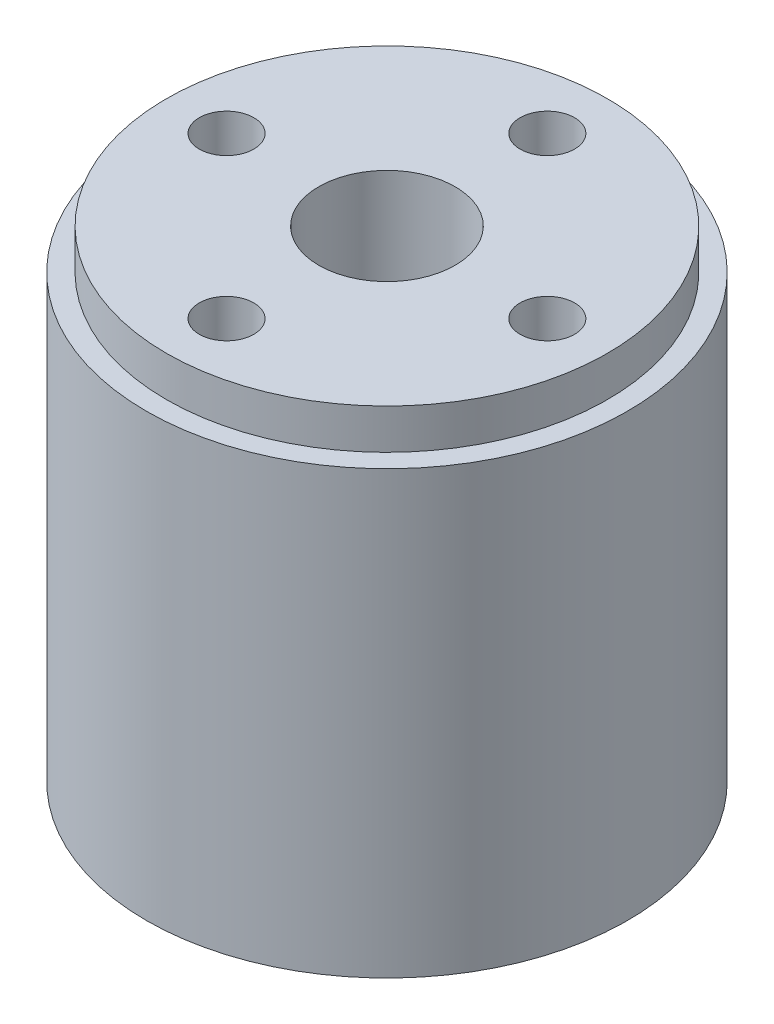
ISO-10303-21;
HEADER;
FILE_DESCRIPTION(('STEP AP214'),'2;1');
FILE_NAME('part.step','',(''),(''),'','','');
FILE_SCHEMA(('AUTOMOTIVE_DESIGN { 1 0 10303 214 1 1 1 1 }'));
ENDSEC;
DATA;
#1=APPLICATION_CONTEXT('core data for automotive mechanical design processes');
#2=APPLICATION_PROTOCOL_DEFINITION('international standard','automotive_design',2000,#1);
#3=PRODUCT_CONTEXT('',#1,'mechanical');
#4=PRODUCT('Part','Part','',(#3));
#5=PRODUCT_RELATED_PRODUCT_CATEGORY('part','',(#4));
#6=PRODUCT_DEFINITION_FORMATION('','',#4);
#7=PRODUCT_DEFINITION_CONTEXT('part definition',#1,'design');
#8=PRODUCT_DEFINITION('design','',#6,#7);
#9=PRODUCT_DEFINITION_SHAPE('','',#8);
#10=(LENGTH_UNIT() NAMED_UNIT(*) SI_UNIT(.MILLI.,.METRE.));
#11=(NAMED_UNIT(*) PLANE_ANGLE_UNIT() SI_UNIT($,.RADIAN.));
#12=(NAMED_UNIT(*) SI_UNIT($,.STERADIAN.) SOLID_ANGLE_UNIT());
#13=UNCERTAINTY_MEASURE_WITH_UNIT(LENGTH_MEASURE(1.E-05),#10,'distance_accuracy_value','');
#14=(GEOMETRIC_REPRESENTATION_CONTEXT(3) GLOBAL_UNCERTAINTY_ASSIGNED_CONTEXT((#13)) GLOBAL_UNIT_ASSIGNED_CONTEXT((#10,
#11,#12)) REPRESENTATION_CONTEXT('',''));
#15=CARTESIAN_POINT('',(0.,0.,0.));
#16=DIRECTION('',(0.,0.,1.));
#17=DIRECTION('',(1.,0.,0.));
#18=AXIS2_PLACEMENT_3D('',#15,#16,#17);
#19=CARTESIAN_POINT('',(0.,60.,0.));
#20=DIRECTION('',(0.,1.,0.));
#21=DIRECTION('',(0.,0.,1.));
#22=AXIS2_PLACEMENT_3D('',#19,#20,#21);
#23=PLANE('',#22);
#24=CARTESIAN_POINT('',(0.,60.,20.));
#25=DIRECTION('',(0.,1.,0.));
#26=DIRECTION('',(0.,0.,1.));
#27=AXIS2_PLACEMENT_3D('',#24,#25,#26);
#28=CIRCLE('',#27,3.40000000000006);
#29=CARTESIAN_POINT('',(0.,60.,23.4000000000001));
#30=VERTEX_POINT('',#29);
#31=EDGE_CURVE('E69',#30,#30,#28,.T.);
#32=ORIENTED_EDGE('',*,*,#31,.F.);
#33=EDGE_LOOP('',(#32));
#34=FACE_BOUND('',#33,.T.);
#35=CARTESIAN_POINT('',(0.,60.,-20.));
#36=DIRECTION('',(0.,1.,0.));
#37=DIRECTION('',(0.,0.,1.));
#38=AXIS2_PLACEMENT_3D('',#35,#36,#37);
#39=CIRCLE('',#38,3.40000000000001);
#40=CARTESIAN_POINT('',(0.,60.,-16.6));
#41=VERTEX_POINT('',#40);
#42=EDGE_CURVE('E57',#41,#41,#39,.T.);
#43=ORIENTED_EDGE('',*,*,#42,.F.);
#44=EDGE_LOOP('',(#43));
#45=FACE_BOUND('',#44,.T.);
#46=CARTESIAN_POINT('',(0.,60.,0.));
#47=DIRECTION('',(0.,1.,0.));
#48=DIRECTION('',(0.,0.,1.));
#49=AXIS2_PLACEMENT_3D('',#46,#47,#48);
#50=CIRCLE('',#49,8.5);
#51=CARTESIAN_POINT('',(0.,60.,8.5));
#52=VERTEX_POINT('',#51);
#53=EDGE_CURVE('E48',#52,#52,#50,.T.);
#54=ORIENTED_EDGE('',*,*,#53,.F.);
#55=EDGE_LOOP('',(#54));
#56=FACE_BOUND('',#55,.T.);
#57=CARTESIAN_POINT('',(-20.,60.,0.));
#58=DIRECTION('',(0.,1.,0.));
#59=DIRECTION('',(0.,0.,1.));
#60=AXIS2_PLACEMENT_3D('',#57,#58,#59);
#61=CIRCLE('',#60,3.4);
#62=CARTESIAN_POINT('',(-20.,60.,3.4));
#63=VERTEX_POINT('',#62);
#64=EDGE_CURVE('E53',#63,#63,#61,.T.);
#65=ORIENTED_EDGE('',*,*,#64,.F.);
#66=EDGE_LOOP('',(#65));
#67=FACE_BOUND('',#66,.T.);
#68=CARTESIAN_POINT('',(20.,60.,1.37209959955431E-13));
#69=DIRECTION('',(0.,1.,0.));
#70=DIRECTION('',(0.,0.,1.));
#71=AXIS2_PLACEMENT_3D('',#68,#69,#70);
#72=CIRCLE('',#71,3.4);
#73=CARTESIAN_POINT('',(20.,60.,3.40000000000014));
#74=VERTEX_POINT('',#73);
#75=EDGE_CURVE('E63',#74,#74,#72,.T.);
#76=ORIENTED_EDGE('',*,*,#75,.F.);
#77=EDGE_LOOP('',(#76));
#78=FACE_BOUND('',#77,.T.);
#79=CARTESIAN_POINT('',(0.,60.,0.));
#80=DIRECTION('',(0.,1.,0.));
#81=DIRECTION('',(0.,0.,1.));
#82=AXIS2_PLACEMENT_3D('',#79,#80,#81);
#83=CIRCLE('',#82,27.5);
#84=CARTESIAN_POINT('',(0.,60.,27.5));
#85=VERTEX_POINT('',#84);
#86=EDGE_CURVE('E81',#85,#85,#83,.T.);
#87=ORIENTED_EDGE('',*,*,#86,.T.);
#88=EDGE_LOOP('',(#87));
#89=FACE_BOUND('',#88,.T.);
#90=ADVANCED_FACE('F32',(#34,#45,#56,#67,#78,#89),#23,.T.);
#91=CARTESIAN_POINT('',(0.,60.,0.));
#92=DIRECTION('',(0.,-1.,0.));
#93=DIRECTION('',(0.,0.,-1.));
#94=AXIS2_PLACEMENT_3D('',#91,#92,#93);
#95=CYLINDRICAL_SURFACE('',#94,30.);
#96=CARTESIAN_POINT('',(0.,0.,0.));
#97=DIRECTION('',(0.,1.,0.));
#98=DIRECTION('',(0.,0.,1.));
#99=AXIS2_PLACEMENT_3D('',#96,#97,#98);
#100=CIRCLE('',#99,30.);
#101=CARTESIAN_POINT('',(0.,0.,30.));
#102=VERTEX_POINT('',#101);
#103=EDGE_CURVE('E44',#102,#102,#100,.T.);
#104=ORIENTED_EDGE('',*,*,#103,.T.);
#105=EDGE_LOOP('',(#104));
#106=FACE_BOUND('',#105,.T.);
#107=CARTESIAN_POINT('',(0.,55.,0.));
#108=DIRECTION('',(0.,1.,0.));
#109=DIRECTION('',(0.,0.,1.));
#110=AXIS2_PLACEMENT_3D('',#107,#108,#109);
#111=CIRCLE('',#110,30.);
#112=CARTESIAN_POINT('',(0.,55.,30.));
#113=VERTEX_POINT('',#112);
#114=EDGE_CURVE('E75',#113,#113,#111,.T.);
#115=ORIENTED_EDGE('',*,*,#114,.F.);
#116=EDGE_LOOP('',(#115));
#117=FACE_BOUND('',#116,.T.);
#118=ADVANCED_FACE('F97',(#106,#117),#95,.T.);
#119=CARTESIAN_POINT('',(0.,0.,0.));
#120=DIRECTION('',(0.,1.,0.));
#121=DIRECTION('',(0.,0.,1.));
#122=AXIS2_PLACEMENT_3D('',#119,#120,#121);
#123=PLANE('',#122);
#124=CARTESIAN_POINT('',(0.,0.,0.));
#125=DIRECTION('',(0.,1.,0.));
#126=DIRECTION('',(0.,0.,1.));
#127=AXIS2_PLACEMENT_3D('',#124,#125,#126);
#128=CIRCLE('',#127,13.5);
#129=CARTESIAN_POINT('',(0.,0.,13.5));
#130=VERTEX_POINT('',#129);
#131=EDGE_CURVE('E40',#130,#130,#128,.T.);
#132=ORIENTED_EDGE('',*,*,#131,.T.);
#133=EDGE_LOOP('',(#132));
#134=FACE_BOUND('',#133,.T.);
#135=ORIENTED_EDGE('',*,*,#103,.F.);
#136=EDGE_LOOP('',(#135));
#137=FACE_BOUND('',#136,.T.);
#138=CARTESIAN_POINT('',(-20.,0.,0.));
#139=DIRECTION('',(0.,1.,0.));
#140=DIRECTION('',(0.,0.,1.));
#141=AXIS2_PLACEMENT_3D('',#138,#139,#140);
#142=CIRCLE('',#141,3.4);
#143=CARTESIAN_POINT('',(-20.,0.,3.4));
#144=VERTEX_POINT('',#143);
#145=EDGE_CURVE('E54',#144,#144,#142,.T.);
#146=ORIENTED_EDGE('',*,*,#145,.T.);
#147=EDGE_LOOP('',(#146));
#148=FACE_BOUND('',#147,.T.);
#149=CARTESIAN_POINT('',(0.,0.,-20.));
#150=DIRECTION('',(0.,1.,0.));
#151=DIRECTION('',(0.,0.,1.));
#152=AXIS2_PLACEMENT_3D('',#149,#150,#151);
#153=CIRCLE('',#152,3.40000000000001);
#154=CARTESIAN_POINT('',(0.,0.,-16.6));
#155=VERTEX_POINT('',#154);
#156=EDGE_CURVE('E60',#155,#155,#153,.T.);
#157=ORIENTED_EDGE('',*,*,#156,.T.);
#158=EDGE_LOOP('',(#157));
#159=FACE_BOUND('',#158,.T.);
#160=CARTESIAN_POINT('',(20.,0.,1.37209959955431E-13));
#161=DIRECTION('',(0.,1.,0.));
#162=DIRECTION('',(0.,0.,1.));
#163=AXIS2_PLACEMENT_3D('',#160,#161,#162);
#164=CIRCLE('',#163,3.4);
#165=CARTESIAN_POINT('',(20.,0.,3.40000000000014));
#166=VERTEX_POINT('',#165);
#167=EDGE_CURVE('E66',#166,#166,#164,.T.);
#168=ORIENTED_EDGE('',*,*,#167,.T.);
#169=EDGE_LOOP('',(#168));
#170=FACE_BOUND('',#169,.T.);
#171=CARTESIAN_POINT('',(0.,0.,20.));
#172=DIRECTION('',(0.,1.,0.));
#173=DIRECTION('',(0.,0.,1.));
#174=AXIS2_PLACEMENT_3D('',#171,#172,#173);
#175=CIRCLE('',#174,3.40000000000006);
#176=CARTESIAN_POINT('',(0.,0.,23.4000000000001));
#177=VERTEX_POINT('',#176);
#178=EDGE_CURVE('E72',#177,#177,#175,.T.);
#179=ORIENTED_EDGE('',*,*,#178,.T.);
#180=EDGE_LOOP('',(#179));
#181=FACE_BOUND('',#180,.T.);
#182=ADVANCED_FACE('F99',(#134,#137,#148,#159,#170,#181),#123,.F.);
#183=CARTESIAN_POINT('',(0.,60.,0.));
#184=DIRECTION('',(0.,-1.,0.));
#185=DIRECTION('',(0.,0.,-1.));
#186=AXIS2_PLACEMENT_3D('',#183,#184,#185);
#187=CYLINDRICAL_SURFACE('',#186,8.5);
#188=CARTESIAN_POINT('',(0.,5.00000000000004,0.));
#189=DIRECTION('',(0.,1.,0.));
#190=DIRECTION('',(0.,0.,1.));
#191=AXIS2_PLACEMENT_3D('',#188,#189,#190);
#192=CIRCLE('',#191,8.5);
#193=CARTESIAN_POINT('',(0.,5.00000000000004,8.5));
#194=VERTEX_POINT('',#193);
#195=EDGE_CURVE('E10',#194,#194,#192,.F.);
#196=ORIENTED_EDGE('',*,*,#195,.T.);
#197=EDGE_LOOP('',(#196));
#198=FACE_BOUND('',#197,.T.);
#199=ORIENTED_EDGE('',*,*,#53,.T.);
#200=EDGE_LOOP('',(#199));
#201=FACE_BOUND('',#200,.T.);
#202=ADVANCED_FACE('F105',(#198,#201),#187,.F.);
#203=CARTESIAN_POINT('',(-20.,60.,0.));
#204=DIRECTION('',(0.,-1.,0.));
#205=DIRECTION('',(0.,0.,-1.));
#206=AXIS2_PLACEMENT_3D('',#203,#204,#205);
#207=CYLINDRICAL_SURFACE('',#206,3.4);
#208=ORIENTED_EDGE('',*,*,#64,.T.);
#209=EDGE_LOOP('',(#208));
#210=FACE_BOUND('',#209,.T.);
#211=ORIENTED_EDGE('',*,*,#145,.F.);
#212=EDGE_LOOP('',(#211));
#213=FACE_BOUND('',#212,.T.);
#214=ADVANCED_FACE('F112',(#210,#213),#207,.F.);
#215=CARTESIAN_POINT('',(0.,60.,-20.));
#216=DIRECTION('',(0.,-1.,0.));
#217=DIRECTION('',(0.,0.,-1.));
#218=AXIS2_PLACEMENT_3D('',#215,#216,#217);
#219=CYLINDRICAL_SURFACE('',#218,3.40000000000001);
#220=ORIENTED_EDGE('',*,*,#42,.T.);
#221=EDGE_LOOP('',(#220));
#222=FACE_BOUND('',#221,.T.);
#223=ORIENTED_EDGE('',*,*,#156,.F.);
#224=EDGE_LOOP('',(#223));
#225=FACE_BOUND('',#224,.T.);
#226=ADVANCED_FACE('F115',(#222,#225),#219,.F.);
#227=CARTESIAN_POINT('',(20.,60.,1.37209959955431E-13));
#228=DIRECTION('',(0.,-1.,0.));
#229=DIRECTION('',(0.,0.,-1.));
#230=AXIS2_PLACEMENT_3D('',#227,#228,#229);
#231=CYLINDRICAL_SURFACE('',#230,3.4);
#232=ORIENTED_EDGE('',*,*,#75,.T.);
#233=EDGE_LOOP('',(#232));
#234=FACE_BOUND('',#233,.T.);
#235=ORIENTED_EDGE('',*,*,#167,.F.);
#236=EDGE_LOOP('',(#235));
#237=FACE_BOUND('',#236,.T.);
#238=ADVANCED_FACE('F119',(#234,#237),#231,.F.);
#239=CARTESIAN_POINT('',(0.,60.,20.));
#240=DIRECTION('',(0.,-1.,0.));
#241=DIRECTION('',(0.,0.,-1.));
#242=AXIS2_PLACEMENT_3D('',#239,#240,#241);
#243=CYLINDRICAL_SURFACE('',#242,3.40000000000006);
#244=ORIENTED_EDGE('',*,*,#31,.T.);
#245=EDGE_LOOP('',(#244));
#246=FACE_BOUND('',#245,.T.);
#247=ORIENTED_EDGE('',*,*,#178,.F.);
#248=EDGE_LOOP('',(#247));
#249=FACE_BOUND('',#248,.T.);
#250=ADVANCED_FACE('F93',(#246,#249),#243,.F.);
#251=CARTESIAN_POINT('',(0.,55.,0.));
#252=DIRECTION('',(0.,1.,0.));
#253=DIRECTION('',(0.,0.,1.));
#254=AXIS2_PLACEMENT_3D('',#251,#252,#253);
#255=PLANE('',#254);
#256=CARTESIAN_POINT('',(0.,55.,0.));
#257=DIRECTION('',(0.,1.,0.));
#258=DIRECTION('',(0.,0.,1.));
#259=AXIS2_PLACEMENT_3D('',#256,#257,#258);
#260=CIRCLE('',#259,27.5);
#261=CARTESIAN_POINT('',(0.,55.,27.5));
#262=VERTEX_POINT('',#261);
#263=EDGE_CURVE('E80',#262,#262,#260,.T.);
#264=ORIENTED_EDGE('',*,*,#263,.F.);
#265=EDGE_LOOP('',(#264));
#266=FACE_BOUND('',#265,.T.);
#267=ORIENTED_EDGE('',*,*,#114,.T.);
#268=EDGE_LOOP('',(#267));
#269=FACE_BOUND('',#268,.T.);
#270=ADVANCED_FACE('F90',(#266,#269),#255,.T.);
#271=CARTESIAN_POINT('',(0.,55.,0.));
#272=DIRECTION('',(0.,1.,0.));
#273=DIRECTION('',(0.,0.,1.));
#274=AXIS2_PLACEMENT_3D('',#271,#272,#273);
#275=CYLINDRICAL_SURFACE('',#274,27.5);
#276=ORIENTED_EDGE('',*,*,#263,.T.);
#277=EDGE_LOOP('',(#276));
#278=FACE_BOUND('',#277,.T.);
#279=ORIENTED_EDGE('',*,*,#86,.F.);
#280=EDGE_LOOP('',(#279));
#281=FACE_BOUND('',#280,.T.);
#282=ADVANCED_FACE('F87',(#278,#281),#275,.T.);
#283=CARTESIAN_POINT('',(0.,0.,0.));
#284=DIRECTION('',(0.,-1.,0.));
#285=DIRECTION('',(0.,0.,-1.));
#286=AXIS2_PLACEMENT_3D('',#283,#284,#285);
#287=CONICAL_SURFACE('',#286,13.5,0.785398163397446);
#288=ORIENTED_EDGE('',*,*,#195,.F.);
#289=EDGE_LOOP('',(#288));
#290=FACE_BOUND('',#289,.T.);
#291=ORIENTED_EDGE('',*,*,#131,.F.);
#292=EDGE_LOOP('',(#291));
#293=FACE_BOUND('',#292,.T.);
#294=ADVANCED_FACE('F35',(#290,#293),#287,.F.);
#295=CLOSED_SHELL('',(#90,#118,#182,#202,#214,#226,#238,#250,#270,#282,#294));
#296=MANIFOLD_SOLID_BREP('B2',#295);
#297=ADVANCED_BREP_SHAPE_REPRESENTATION('',(#18,#296),#14);
#298=SHAPE_DEFINITION_REPRESENTATION(#9,#297);
ENDSEC;
END-ISO-10303-21;
